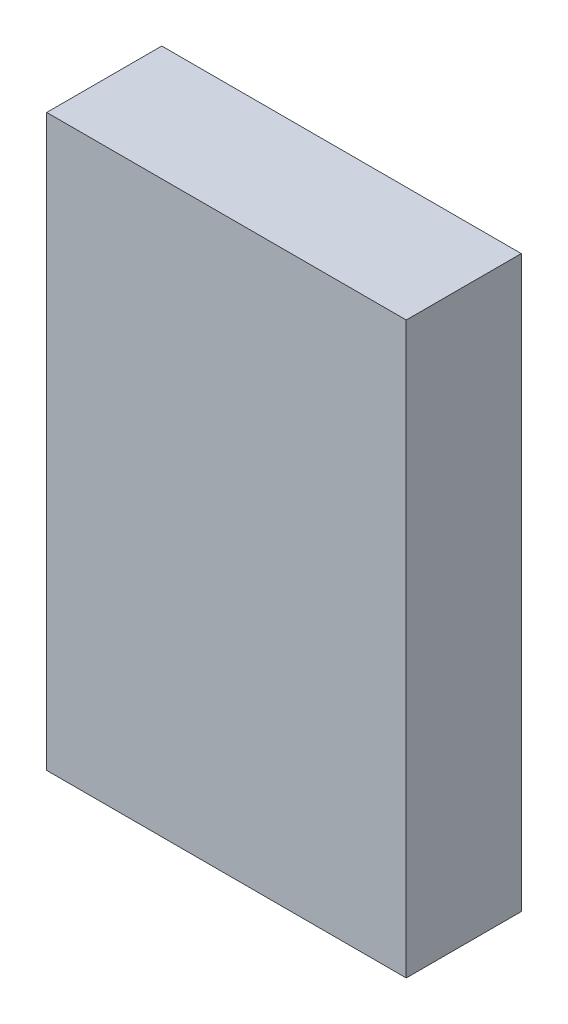
ISO-10303-21;
HEADER;
FILE_DESCRIPTION(('STEP AP214'),'2;1');
FILE_NAME('part.step','',(''),(''),'','','');
FILE_SCHEMA(('AUTOMOTIVE_DESIGN { 1 0 10303 214 1 1 1 1 }'));
ENDSEC;
DATA;
#1=APPLICATION_CONTEXT('core data for automotive mechanical design processes');
#2=APPLICATION_PROTOCOL_DEFINITION('international standard','automotive_design',2000,#1);
#3=PRODUCT_CONTEXT('',#1,'mechanical');
#4=PRODUCT('Part','Part','',(#3));
#5=PRODUCT_RELATED_PRODUCT_CATEGORY('part','',(#4));
#6=PRODUCT_DEFINITION_FORMATION('','',#4);
#7=PRODUCT_DEFINITION_CONTEXT('part definition',#1,'design');
#8=PRODUCT_DEFINITION('design','',#6,#7);
#9=PRODUCT_DEFINITION_SHAPE('','',#8);
#10=(LENGTH_UNIT() NAMED_UNIT(*) SI_UNIT(.MILLI.,.METRE.));
#11=(NAMED_UNIT(*) PLANE_ANGLE_UNIT() SI_UNIT($,.RADIAN.));
#12=(NAMED_UNIT(*) SI_UNIT($,.STERADIAN.) SOLID_ANGLE_UNIT());
#13=UNCERTAINTY_MEASURE_WITH_UNIT(LENGTH_MEASURE(1.E-05),#10,'distance_accuracy_value','');
#14=(GEOMETRIC_REPRESENTATION_CONTEXT(3) GLOBAL_UNCERTAINTY_ASSIGNED_CONTEXT((#13)) GLOBAL_UNIT_ASSIGNED_CONTEXT((#10,
#11,#12)) REPRESENTATION_CONTEXT('',''));
#15=CARTESIAN_POINT('',(0.,0.,0.));
#16=DIRECTION('',(0.,0.,1.));
#17=DIRECTION('',(1.,0.,0.));
#18=AXIS2_PLACEMENT_3D('',#15,#16,#17);
#19=CARTESIAN_POINT('',(0.,61.4255890208423,1.6));
#20=DIRECTION('',(1.,0.,0.));
#21=DIRECTION('',(0.,0.,-1.));
#22=AXIS2_PLACEMENT_3D('',#19,#20,#21);
#23=PLANE('',#22);
#24=DIRECTION('',(0.,-1.,0.));
#25=VECTOR('',#24,1.);
#26=CARTESIAN_POINT('',(0.,61.4255890208423,0.));
#27=LINE('',#26,#25);
#28=CARTESIAN_POINT('',(0.,69.3505890208423,0.));
#29=VERTEX_POINT('',#28);
#30=CARTESIAN_POINT('',(0.,61.4255890208423,0.));
#31=VERTEX_POINT('',#30);
#32=EDGE_CURVE('E98',#29,#31,#27,.T.);
#33=ORIENTED_EDGE('',*,*,#32,.T.);
#34=DIRECTION('',(0.,0.,-1.));
#35=VECTOR('',#34,1.);
#36=CARTESIAN_POINT('',(0.,61.4255890208423,1.6));
#37=LINE('',#36,#35);
#38=CARTESIAN_POINT('',(0.,61.4255890208423,1.6));
#39=VERTEX_POINT('',#38);
#40=EDGE_CURVE('E11',#39,#31,#37,.T.);
#41=ORIENTED_EDGE('',*,*,#40,.F.);
#42=DIRECTION('',(0.,-1.,0.));
#43=VECTOR('',#42,1.);
#44=CARTESIAN_POINT('',(0.,61.4255890208423,1.6));
#45=LINE('',#44,#43);
#46=CARTESIAN_POINT('',(0.,69.3505890208423,1.6));
#47=VERTEX_POINT('',#46);
#48=EDGE_CURVE('E86',#47,#39,#45,.T.);
#49=ORIENTED_EDGE('',*,*,#48,.F.);
#50=DIRECTION('',(0.,0.,-1.));
#51=VECTOR('',#50,1.);
#52=CARTESIAN_POINT('',(0.,69.3505890208423,1.6));
#53=LINE('',#52,#51);
#54=EDGE_CURVE('E94',#47,#29,#53,.T.);
#55=ORIENTED_EDGE('',*,*,#54,.T.);
#56=EDGE_LOOP('',(#33,#41,#49,#55));
#57=FACE_BOUND('',#56,.T.);
#58=ADVANCED_FACE('F35',(#57),#23,.F.);
#59=CARTESIAN_POINT('',(0.,61.4255890208423,1.6));
#60=DIRECTION('',(0.,1.,0.));
#61=DIRECTION('',(-1.,0.,0.));
#62=AXIS2_PLACEMENT_3D('',#59,#60,#61);
#63=PLANE('',#62);
#64=DIRECTION('',(1.,0.,0.));
#65=VECTOR('',#64,1.);
#66=CARTESIAN_POINT('',(0.,61.4255890208423,0.));
#67=LINE('',#66,#65);
#68=CARTESIAN_POINT('',(5.,61.4255890208422,0.));
#69=VERTEX_POINT('',#68);
#70=EDGE_CURVE('E90',#31,#69,#67,.T.);
#71=ORIENTED_EDGE('',*,*,#70,.T.);
#72=DIRECTION('',(0.,0.,-1.));
#73=VECTOR('',#72,1.);
#74=CARTESIAN_POINT('',(5.,61.4255890208422,1.6));
#75=LINE('',#74,#73);
#76=CARTESIAN_POINT('',(5.,61.4255890208422,1.6));
#77=VERTEX_POINT('',#76);
#78=EDGE_CURVE('E43',#77,#69,#75,.T.);
#79=ORIENTED_EDGE('',*,*,#78,.F.);
#80=DIRECTION('',(1.,0.,0.));
#81=VECTOR('',#80,1.);
#82=CARTESIAN_POINT('',(0.,61.4255890208423,1.6));
#83=LINE('',#82,#81);
#84=EDGE_CURVE('E81',#39,#77,#83,.T.);
#85=ORIENTED_EDGE('',*,*,#84,.F.);
#86=ORIENTED_EDGE('',*,*,#40,.T.);
#87=EDGE_LOOP('',(#71,#79,#85,#86));
#88=FACE_BOUND('',#87,.T.);
#89=ADVANCED_FACE('F89',(#88),#63,.F.);
#90=CARTESIAN_POINT('',(5.,61.4255890208422,1.6));
#91=DIRECTION('',(-1.,0.,0.));
#92=DIRECTION('',(0.,0.,1.));
#93=AXIS2_PLACEMENT_3D('',#90,#91,#92);
#94=PLANE('',#93);
#95=DIRECTION('',(0.,1.,0.));
#96=VECTOR('',#95,1.);
#97=CARTESIAN_POINT('',(5.,61.4255890208422,0.));
#98=LINE('',#97,#96);
#99=CARTESIAN_POINT('',(5.,69.3505890208423,0.));
#100=VERTEX_POINT('',#99);
#101=EDGE_CURVE('E68',#69,#100,#98,.T.);
#102=ORIENTED_EDGE('',*,*,#101,.T.);
#103=DIRECTION('',(0.,0.,-1.));
#104=VECTOR('',#103,1.);
#105=CARTESIAN_POINT('',(5.,69.3505890208423,1.6));
#106=LINE('',#105,#104);
#107=CARTESIAN_POINT('',(5.,69.3505890208423,1.6));
#108=VERTEX_POINT('',#107);
#109=EDGE_CURVE('E91',#108,#100,#106,.T.);
#110=ORIENTED_EDGE('',*,*,#109,.F.);
#111=DIRECTION('',(0.,1.,0.));
#112=VECTOR('',#111,1.);
#113=CARTESIAN_POINT('',(5.,61.4255890208422,1.6));
#114=LINE('',#113,#112);
#115=EDGE_CURVE('E84',#77,#108,#114,.T.);
#116=ORIENTED_EDGE('',*,*,#115,.F.);
#117=ORIENTED_EDGE('',*,*,#78,.T.);
#118=EDGE_LOOP('',(#102,#110,#116,#117));
#119=FACE_BOUND('',#118,.T.);
#120=ADVANCED_FACE('F92',(#119),#94,.F.);
#121=CARTESIAN_POINT('',(0.,69.3505890208423,1.6));
#122=DIRECTION('',(0.,-1.,0.));
#123=DIRECTION('',(0.,0.,-1.));
#124=AXIS2_PLACEMENT_3D('',#121,#122,#123);
#125=PLANE('',#124);
#126=DIRECTION('',(-1.,0.,0.));
#127=VECTOR('',#126,1.);
#128=CARTESIAN_POINT('',(0.,69.3505890208423,0.));
#129=LINE('',#128,#127);
#130=EDGE_CURVE('E74',#100,#29,#129,.T.);
#131=ORIENTED_EDGE('',*,*,#130,.T.);
#132=ORIENTED_EDGE('',*,*,#54,.F.);
#133=DIRECTION('',(-1.,0.,0.));
#134=VECTOR('',#133,1.);
#135=CARTESIAN_POINT('',(0.,69.3505890208423,1.6));
#136=LINE('',#135,#134);
#137=EDGE_CURVE('E51',#108,#47,#136,.T.);
#138=ORIENTED_EDGE('',*,*,#137,.F.);
#139=ORIENTED_EDGE('',*,*,#109,.T.);
#140=EDGE_LOOP('',(#131,#132,#138,#139));
#141=FACE_BOUND('',#140,.T.);
#142=ADVANCED_FACE('F105',(#141),#125,.F.);
#143=CARTESIAN_POINT('',(0.,0.,1.6));
#144=DIRECTION('',(0.,0.,-1.));
#145=DIRECTION('',(-1.,0.,0.));
#146=AXIS2_PLACEMENT_3D('',#143,#144,#145);
#147=PLANE('',#146);
#148=ORIENTED_EDGE('',*,*,#48,.T.);
#149=ORIENTED_EDGE('',*,*,#84,.T.);
#150=ORIENTED_EDGE('',*,*,#115,.T.);
#151=ORIENTED_EDGE('',*,*,#137,.T.);
#152=EDGE_LOOP('',(#148,#149,#150,#151));
#153=FACE_BOUND('',#152,.T.);
#154=ADVANCED_FACE('F82',(#153),#147,.F.);
#155=CARTESIAN_POINT('',(0.,0.,0.));
#156=DIRECTION('',(0.,0.,-1.));
#157=DIRECTION('',(-1.,0.,0.));
#158=AXIS2_PLACEMENT_3D('',#155,#156,#157);
#159=PLANE('',#158);
#160=ORIENTED_EDGE('',*,*,#32,.F.);
#161=ORIENTED_EDGE('',*,*,#130,.F.);
#162=ORIENTED_EDGE('',*,*,#101,.F.);
#163=ORIENTED_EDGE('',*,*,#70,.F.);
#164=EDGE_LOOP('',(#160,#161,#162,#163));
#165=FACE_BOUND('',#164,.T.);
#166=ADVANCED_FACE('F108',(#165),#159,.T.);
#167=CLOSED_SHELL('',(#58,#89,#120,#142,#154,#166));
#168=MANIFOLD_SOLID_BREP('B2',#167);
#169=ADVANCED_BREP_SHAPE_REPRESENTATION('',(#18,#168),#14);
#170=SHAPE_DEFINITION_REPRESENTATION(#9,#169);
ENDSEC;
END-ISO-10303-21;
